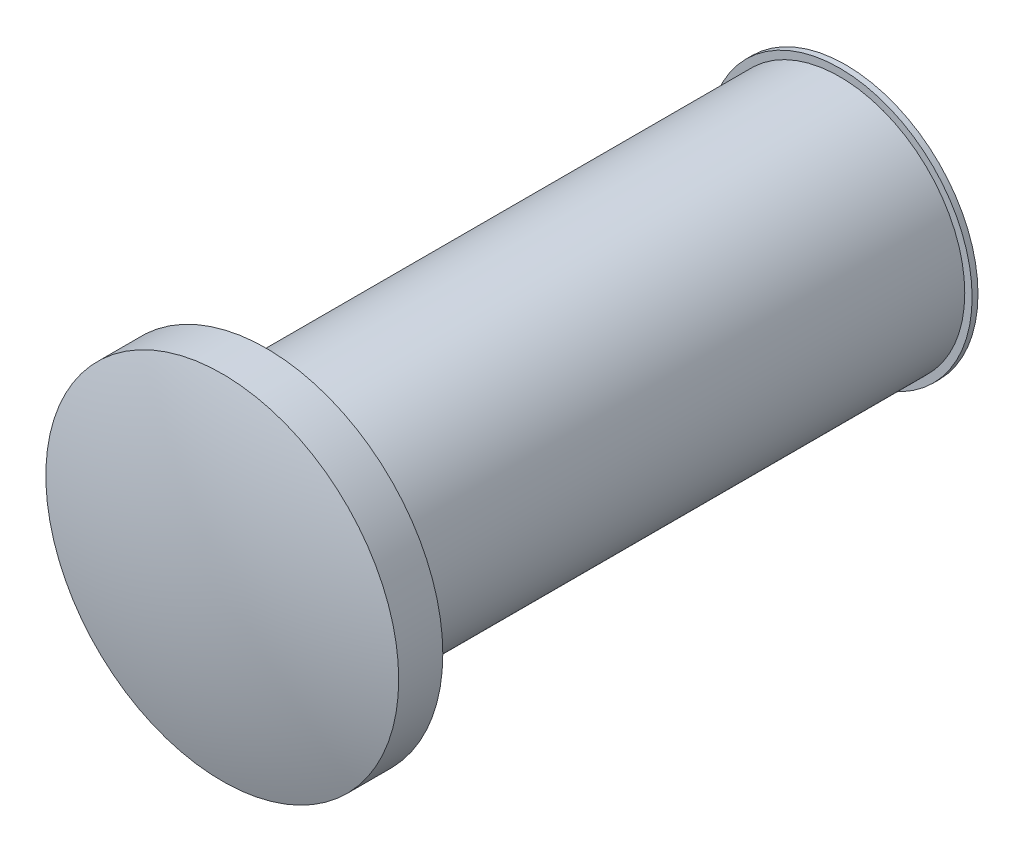
ISO-10303-21;
HEADER;
FILE_DESCRIPTION(('STEP AP214'),'2;1');
FILE_NAME('part.step','',(''),(''),'','','');
FILE_SCHEMA(('AUTOMOTIVE_DESIGN { 1 0 10303 214 1 1 1 1 }'));
ENDSEC;
DATA;
#1=APPLICATION_CONTEXT('core data for automotive mechanical design processes');
#2=APPLICATION_PROTOCOL_DEFINITION('international standard','automotive_design',2000,#1);
#3=PRODUCT_CONTEXT('',#1,'mechanical');
#4=PRODUCT('Part','Part','',(#3));
#5=PRODUCT_RELATED_PRODUCT_CATEGORY('part','',(#4));
#6=PRODUCT_DEFINITION_FORMATION('','',#4);
#7=PRODUCT_DEFINITION_CONTEXT('part definition',#1,'design');
#8=PRODUCT_DEFINITION('design','',#6,#7);
#9=PRODUCT_DEFINITION_SHAPE('','',#8);
#10=(LENGTH_UNIT() NAMED_UNIT(*) SI_UNIT(.MILLI.,.METRE.));
#11=(NAMED_UNIT(*) PLANE_ANGLE_UNIT() SI_UNIT($,.RADIAN.));
#12=(NAMED_UNIT(*) SI_UNIT($,.STERADIAN.) SOLID_ANGLE_UNIT());
#13=UNCERTAINTY_MEASURE_WITH_UNIT(LENGTH_MEASURE(1.E-05),#10,'distance_accuracy_value','');
#14=(GEOMETRIC_REPRESENTATION_CONTEXT(3) GLOBAL_UNCERTAINTY_ASSIGNED_CONTEXT((#13)) GLOBAL_UNIT_ASSIGNED_CONTEXT((#10,
#11,#12)) REPRESENTATION_CONTEXT('',''));
#15=CARTESIAN_POINT('',(0.,0.,0.));
#16=DIRECTION('',(0.,0.,1.));
#17=DIRECTION('',(1.,0.,0.));
#18=AXIS2_PLACEMENT_3D('',#15,#16,#17);
#19=CARTESIAN_POINT('',(0.,0.,4.953));
#20=DIRECTION('',(0.,0.,-1.));
#21=DIRECTION('',(-1.,0.,0.));
#22=AXIS2_PLACEMENT_3D('',#19,#20,#21);
#23=CYLINDRICAL_SURFACE('',#22,1.0795);
#24=CARTESIAN_POINT('',(0.,0.,4.953));
#25=DIRECTION('',(0.,0.,1.));
#26=DIRECTION('',(1.,0.,0.));
#27=AXIS2_PLACEMENT_3D('',#24,#25,#26);
#28=CIRCLE('',#27,1.0795);
#29=CARTESIAN_POINT('',(1.0795,0.,4.953));
#30=VERTEX_POINT('',#29);
#31=EDGE_CURVE('E10',#30,#30,#28,.T.);
#32=ORIENTED_EDGE('',*,*,#31,.F.);
#33=EDGE_LOOP('',(#32));
#34=FACE_BOUND('',#33,.T.);
#35=CARTESIAN_POINT('',(0.,0.,0.));
#36=DIRECTION('',(0.,0.,1.));
#37=DIRECTION('',(1.,0.,0.));
#38=AXIS2_PLACEMENT_3D('',#35,#36,#37);
#39=CIRCLE('',#38,1.0795);
#40=CARTESIAN_POINT('',(1.0795,0.,0.));
#41=VERTEX_POINT('',#40);
#42=EDGE_CURVE('E51',#41,#41,#39,.T.);
#43=ORIENTED_EDGE('',*,*,#42,.T.);
#44=EDGE_LOOP('',(#43));
#45=FACE_BOUND('',#44,.T.);
#46=ADVANCED_FACE('F36',(#34,#45),#23,.T.);
#47=CARTESIAN_POINT('',(0.,0.,5.334));
#48=DIRECTION('',(0.,0.,-1.));
#49=DIRECTION('',(-1.,0.,0.));
#50=AXIS2_PLACEMENT_3D('',#47,#48,#49);
#51=CYLINDRICAL_SURFACE('',#50,1.524);
#52=CARTESIAN_POINT('',(0.,0.,5.334));
#53=DIRECTION('',(0.,0.,1.));
#54=DIRECTION('',(1.,0.,0.));
#55=AXIS2_PLACEMENT_3D('',#52,#53,#54);
#56=CIRCLE('',#55,1.524);
#57=CARTESIAN_POINT('',(1.524,0.,5.334));
#58=VERTEX_POINT('',#57);
#59=EDGE_CURVE('E40',#58,#58,#56,.T.);
#60=ORIENTED_EDGE('',*,*,#59,.F.);
#61=EDGE_LOOP('',(#60));
#62=FACE_BOUND('',#61,.T.);
#63=CARTESIAN_POINT('',(0.,0.,4.953));
#64=DIRECTION('',(0.,0.,1.));
#65=DIRECTION('',(1.,0.,0.));
#66=AXIS2_PLACEMENT_3D('',#63,#64,#65);
#67=CIRCLE('',#66,1.524);
#68=CARTESIAN_POINT('',(1.524,0.,4.953));
#69=VERTEX_POINT('',#68);
#70=EDGE_CURVE('E48',#69,#69,#67,.T.);
#71=ORIENTED_EDGE('',*,*,#70,.T.);
#72=EDGE_LOOP('',(#71));
#73=FACE_BOUND('',#72,.T.);
#74=ADVANCED_FACE('F94',(#62,#73),#51,.T.);
#75=CARTESIAN_POINT('',(0.,0.,0.368299999999997));
#76=DIRECTION('',(0.,0.,1.));
#77=DIRECTION('',(1.,0.,0.));
#78=AXIS2_PLACEMENT_3D('',#75,#76,#77);
#79=SPHERICAL_SURFACE('',#78,5.1943);
#80=ORIENTED_EDGE('',*,*,#59,.T.);
#81=EDGE_LOOP('',(#80));
#82=FACE_BOUND('',#81,.T.);
#83=ADVANCED_FACE('F38',(#82),#79,.T.);
#84=CARTESIAN_POINT('',(0.,0.,4.953));
#85=DIRECTION('',(0.,0.,1.));
#86=DIRECTION('',(1.,0.,0.));
#87=AXIS2_PLACEMENT_3D('',#84,#85,#86);
#88=PLANE('',#87);
#89=ORIENTED_EDGE('',*,*,#31,.T.);
#90=EDGE_LOOP('',(#89));
#91=FACE_BOUND('',#90,.T.);
#92=ORIENTED_EDGE('',*,*,#70,.F.);
#93=EDGE_LOOP('',(#92));
#94=FACE_BOUND('',#93,.T.);
#95=ADVANCED_FACE('F90',(#91,#94),#88,.F.);
#96=CARTESIAN_POINT('',(0.,0.,-0.0508000000000002));
#97=DIRECTION('',(0.,0.,1.));
#98=DIRECTION('',(1.,0.,0.));
#99=AXIS2_PLACEMENT_3D('',#96,#97,#98);
#100=CYLINDRICAL_SURFACE('',#99,1.143);
#101=CARTESIAN_POINT('',(0.,0.,-0.0508000000000002));
#102=DIRECTION('',(0.,0.,-1.));
#103=DIRECTION('',(-1.,0.,0.));
#104=AXIS2_PLACEMENT_3D('',#101,#102,#103);
#105=CIRCLE('',#104,1.143);
#106=CARTESIAN_POINT('',(-1.143,0.,-0.0508000000000002));
#107=VERTEX_POINT('',#106);
#108=EDGE_CURVE('E53',#107,#107,#105,.T.);
#109=ORIENTED_EDGE('',*,*,#108,.F.);
#110=EDGE_LOOP('',(#109));
#111=FACE_BOUND('',#110,.T.);
#112=CARTESIAN_POINT('',(0.,0.,0.));
#113=DIRECTION('',(0.,0.,-1.));
#114=DIRECTION('',(-1.,0.,0.));
#115=AXIS2_PLACEMENT_3D('',#112,#113,#114);
#116=CIRCLE('',#115,1.143);
#117=CARTESIAN_POINT('',(-1.143,0.,0.));
#118=VERTEX_POINT('',#117);
#119=EDGE_CURVE('E58',#118,#118,#116,.T.);
#120=ORIENTED_EDGE('',*,*,#119,.T.);
#121=EDGE_LOOP('',(#120));
#122=FACE_BOUND('',#121,.T.);
#123=ADVANCED_FACE('F82',(#111,#122),#100,.T.);
#124=CARTESIAN_POINT('',(0.,0.,-0.0508000000000002));
#125=DIRECTION('',(0.,0.,-1.));
#126=DIRECTION('',(-1.,0.,0.));
#127=AXIS2_PLACEMENT_3D('',#124,#125,#126);
#128=PLANE('',#127);
#129=CARTESIAN_POINT('',(0.,0.,-0.0508000000000002));
#130=DIRECTION('',(0.,0.,-1.));
#131=DIRECTION('',(-1.,0.,0.));
#132=AXIS2_PLACEMENT_3D('',#129,#130,#131);
#133=CIRCLE('',#132,1.0668);
#134=CARTESIAN_POINT('',(-1.0668,0.,-0.0508000000000002));
#135=VERTEX_POINT('',#134);
#136=EDGE_CURVE('E65',#135,#135,#133,.T.);
#137=ORIENTED_EDGE('',*,*,#136,.F.);
#138=EDGE_LOOP('',(#137));
#139=FACE_BOUND('',#138,.T.);
#140=ORIENTED_EDGE('',*,*,#108,.T.);
#141=EDGE_LOOP('',(#140));
#142=FACE_BOUND('',#141,.T.);
#143=ADVANCED_FACE('F80',(#139,#142),#128,.T.);
#144=CARTESIAN_POINT('',(0.,0.,0.));
#145=DIRECTION('',(0.,0.,-1.));
#146=DIRECTION('',(-1.,0.,0.));
#147=AXIS2_PLACEMENT_3D('',#144,#145,#146);
#148=PLANE('',#147);
#149=ORIENTED_EDGE('',*,*,#42,.F.);
#150=EDGE_LOOP('',(#149));
#151=FACE_BOUND('',#150,.T.);
#152=ORIENTED_EDGE('',*,*,#119,.F.);
#153=EDGE_LOOP('',(#152));
#154=FACE_BOUND('',#153,.T.);
#155=ADVANCED_FACE('F76',(#151,#154),#148,.F.);
#156=CARTESIAN_POINT('',(0.,0.,0.0762000000000002));
#157=DIRECTION('',(0.,0.,-1.));
#158=DIRECTION('',(-1.,0.,0.));
#159=AXIS2_PLACEMENT_3D('',#156,#157,#158);
#160=CYLINDRICAL_SURFACE('',#159,1.0668);
#161=CARTESIAN_POINT('',(0.,0.,0.0762000000000002));
#162=DIRECTION('',(0.,0.,-1.));
#163=DIRECTION('',(-1.,0.,0.));
#164=AXIS2_PLACEMENT_3D('',#161,#162,#163);
#165=CIRCLE('',#164,1.0668);
#166=CARTESIAN_POINT('',(-1.0668,0.,0.0762000000000002));
#167=VERTEX_POINT('',#166);
#168=EDGE_CURVE('E63',#167,#167,#165,.T.);
#169=ORIENTED_EDGE('',*,*,#168,.F.);
#170=EDGE_LOOP('',(#169));
#171=FACE_BOUND('',#170,.T.);
#172=ORIENTED_EDGE('',*,*,#136,.T.);
#173=EDGE_LOOP('',(#172));
#174=FACE_BOUND('',#173,.T.);
#175=ADVANCED_FACE('F73',(#171,#174),#160,.F.);
#176=CARTESIAN_POINT('',(0.,0.,0.0762000000000002));
#177=DIRECTION('',(0.,0.,-1.));
#178=DIRECTION('',(-1.,0.,0.));
#179=AXIS2_PLACEMENT_3D('',#176,#177,#178);
#180=PLANE('',#179);
#181=ORIENTED_EDGE('',*,*,#168,.T.);
#182=EDGE_LOOP('',(#181));
#183=FACE_BOUND('',#182,.T.);
#184=ADVANCED_FACE('F71',(#183),#180,.T.);
#185=CLOSED_SHELL('',(#46,#74,#83,#95,#123,#143,#155,#175,#184));
#186=MANIFOLD_SOLID_BREP('B2',#185);
#187=ADVANCED_BREP_SHAPE_REPRESENTATION('',(#18,#186),#14);
#188=SHAPE_DEFINITION_REPRESENTATION(#9,#187);
ENDSEC;
END-ISO-10303-21;
